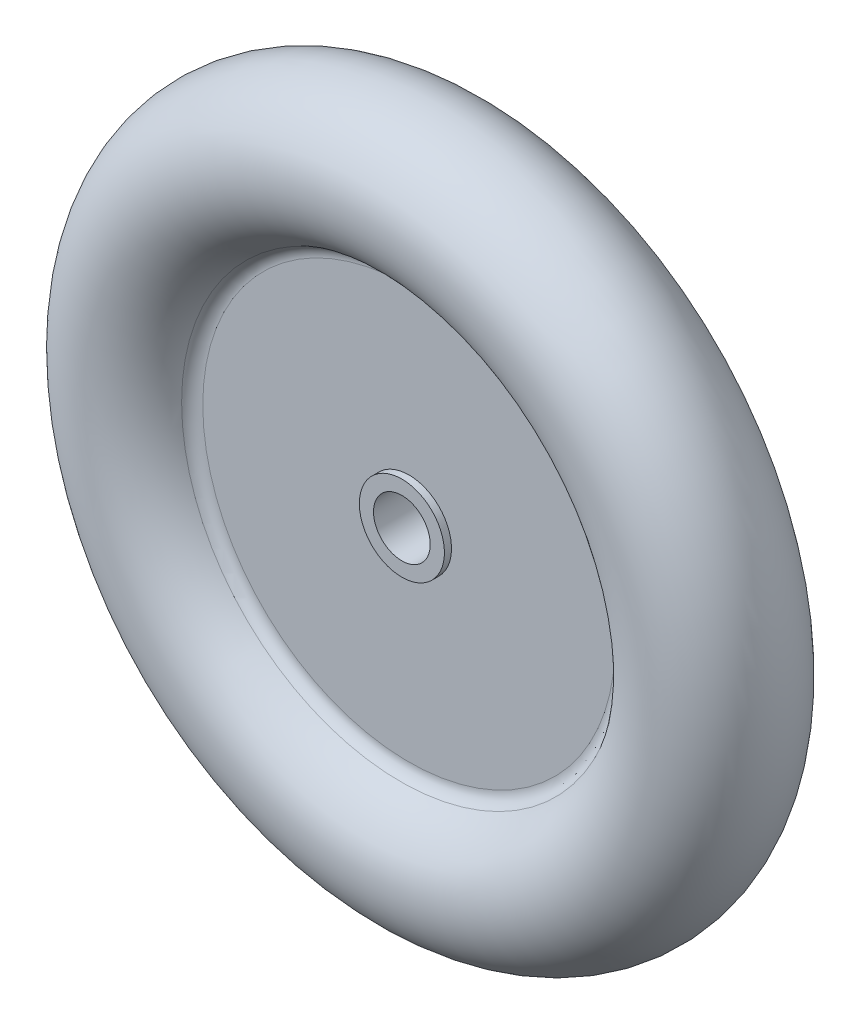
ISO-10303-21;
HEADER;
FILE_DESCRIPTION(('STEP AP214'),'2;1');
FILE_NAME('part.step','',(''),(''),'','','');
FILE_SCHEMA(('AUTOMOTIVE_DESIGN { 1 0 10303 214 1 1 1 1 }'));
ENDSEC;
DATA;
#1=APPLICATION_CONTEXT('core data for automotive mechanical design processes');
#2=APPLICATION_PROTOCOL_DEFINITION('international standard','automotive_design',2000,#1);
#3=PRODUCT_CONTEXT('',#1,'mechanical');
#4=PRODUCT('Part','Part','',(#3));
#5=PRODUCT_RELATED_PRODUCT_CATEGORY('part','',(#4));
#6=PRODUCT_DEFINITION_FORMATION('','',#4);
#7=PRODUCT_DEFINITION_CONTEXT('part definition',#1,'design');
#8=PRODUCT_DEFINITION('design','',#6,#7);
#9=PRODUCT_DEFINITION_SHAPE('','',#8);
#10=(LENGTH_UNIT() NAMED_UNIT(*) SI_UNIT(.MILLI.,.METRE.));
#11=(NAMED_UNIT(*) PLANE_ANGLE_UNIT() SI_UNIT($,.RADIAN.));
#12=(NAMED_UNIT(*) SI_UNIT($,.STERADIAN.) SOLID_ANGLE_UNIT());
#13=UNCERTAINTY_MEASURE_WITH_UNIT(LENGTH_MEASURE(1.E-05),#10,'distance_accuracy_value','');
#14=(GEOMETRIC_REPRESENTATION_CONTEXT(3) GLOBAL_UNCERTAINTY_ASSIGNED_CONTEXT((#13)) GLOBAL_UNIT_ASSIGNED_CONTEXT((#10,
#11,#12)) REPRESENTATION_CONTEXT('',''));
#15=CARTESIAN_POINT('',(0.,0.,0.));
#16=DIRECTION('',(0.,0.,1.));
#17=DIRECTION('',(1.,0.,0.));
#18=AXIS2_PLACEMENT_3D('',#15,#16,#17);
#19=CARTESIAN_POINT('',(0.,2.,-2.));
#20=DIRECTION('',(0.,0.,-1.));
#21=DIRECTION('',(-1.,0.,0.));
#22=AXIS2_PLACEMENT_3D('',#19,#20,#21);
#23=PLANE('',#22);
#24=CARTESIAN_POINT('',(0.,0.,-2.));
#25=DIRECTION('',(0.,0.,-1.));
#26=DIRECTION('',(-1.,0.,0.));
#27=AXIS2_PLACEMENT_3D('',#24,#25,#26);
#28=CIRCLE('',#27,3.);
#29=CARTESIAN_POINT('',(-3.,0.,-2.));
#30=VERTEX_POINT('',#29);
#31=EDGE_CURVE('E10',#30,#30,#28,.T.);
#32=ORIENTED_EDGE('',*,*,#31,.T.);
#33=EDGE_LOOP('',(#32));
#34=FACE_BOUND('',#33,.T.);
#35=CARTESIAN_POINT('',(0.,0.,-2.));
#36=DIRECTION('',(0.,0.,-1.));
#37=DIRECTION('',(-1.,0.,0.));
#38=AXIS2_PLACEMENT_3D('',#35,#36,#37);
#39=CIRCLE('',#38,2.);
#40=CARTESIAN_POINT('',(-2.,0.,-2.));
#41=VERTEX_POINT('',#40);
#42=EDGE_CURVE('E62',#41,#41,#39,.T.);
#43=ORIENTED_EDGE('',*,*,#42,.F.);
#44=EDGE_LOOP('',(#43));
#45=FACE_BOUND('',#44,.T.);
#46=ADVANCED_FACE('F28',(#34,#45),#23,.T.);
#47=CARTESIAN_POINT('',(0.,0.,-18.1622037914692));
#48=DIRECTION('',(0.,0.,-1.));
#49=DIRECTION('',(-1.,0.,0.));
#50=AXIS2_PLACEMENT_3D('',#47,#48,#49);
#51=CYLINDRICAL_SURFACE('',#50,3.);
#52=CARTESIAN_POINT('',(0.,0.,-1.5));
#53=DIRECTION('',(0.,0.,-1.));
#54=DIRECTION('',(-1.,0.,0.));
#55=AXIS2_PLACEMENT_3D('',#52,#53,#54);
#56=CIRCLE('',#55,3.);
#57=CARTESIAN_POINT('',(-3.,0.,-1.5));
#58=VERTEX_POINT('',#57);
#59=EDGE_CURVE('E34',#58,#58,#56,.T.);
#60=ORIENTED_EDGE('',*,*,#59,.T.);
#61=EDGE_LOOP('',(#60));
#62=FACE_BOUND('',#61,.T.);
#63=ORIENTED_EDGE('',*,*,#31,.F.);
#64=EDGE_LOOP('',(#63));
#65=FACE_BOUND('',#64,.T.);
#66=ADVANCED_FACE('F70',(#62,#65),#51,.T.);
#67=CARTESIAN_POINT('',(0.,3.,-1.5));
#68=DIRECTION('',(0.,0.,-1.));
#69=DIRECTION('',(-1.,0.,0.));
#70=AXIS2_PLACEMENT_3D('',#67,#68,#69);
#71=PLANE('',#70);
#72=CARTESIAN_POINT('',(0.,0.,-1.5));
#73=DIRECTION('',(0.,0.,-1.));
#74=DIRECTION('',(-1.,0.,0.));
#75=AXIS2_PLACEMENT_3D('',#72,#73,#74);
#76=CIRCLE('',#75,14.5456439426821);
#77=CARTESIAN_POINT('',(-14.5456439426821,0.,-1.5));
#78=VERTEX_POINT('',#77);
#79=EDGE_CURVE('E38',#78,#78,#76,.T.);
#80=ORIENTED_EDGE('',*,*,#79,.T.);
#81=EDGE_LOOP('',(#80));
#82=FACE_BOUND('',#81,.T.);
#83=ORIENTED_EDGE('',*,*,#59,.F.);
#84=EDGE_LOOP('',(#83));
#85=FACE_BOUND('',#84,.T.);
#86=ADVANCED_FACE('F74',(#82,#85),#71,.T.);
#87=CARTESIAN_POINT('',(0.,0.,-2.5));
#88=DIRECTION('',(0.,0.,-1.));
#89=DIRECTION('',(-1.,0.,0.));
#90=AXIS2_PLACEMENT_3D('',#87,#88,#89);
#91=TOROIDAL_SURFACE('',#90,14.5456439426821,1.);
#92=CARTESIAN_POINT('',(0.,0.,-2.08333333333333));
#93=DIRECTION('',(0.,0.,-1.));
#94=DIRECTION('',(-1.,0.,0.));
#95=AXIS2_PLACEMENT_3D('',#92,#93,#94);
#96=CIRCLE('',#95,15.4547032855685);
#97=CARTESIAN_POINT('',(-15.4547032855685,0.,-2.08333333333333));
#98=VERTEX_POINT('',#97);
#99=EDGE_CURVE('E42',#98,#98,#96,.T.);
#100=ORIENTED_EDGE('',*,*,#99,.T.);
#101=EDGE_LOOP('',(#100));
#102=FACE_BOUND('',#101,.T.);
#103=ORIENTED_EDGE('',*,*,#79,.F.);
#104=EDGE_LOOP('',(#103));
#105=FACE_BOUND('',#104,.T.);
#106=ADVANCED_FACE('F78',(#102,#105),#91,.F.);
#107=CARTESIAN_POINT('',(0.,0.,0.));
#108=DIRECTION('',(0.,0.,-1.));
#109=DIRECTION('',(-1.,0.,0.));
#110=AXIS2_PLACEMENT_3D('',#107,#108,#109);
#111=TOROIDAL_SURFACE('',#110,20.,5.);
#112=CARTESIAN_POINT('',(0.,0.,2.08333333333333));
#113=DIRECTION('',(0.,0.,-1.));
#114=DIRECTION('',(-1.,0.,0.));
#115=AXIS2_PLACEMENT_3D('',#112,#113,#114);
#116=CIRCLE('',#115,15.4547032855685);
#117=CARTESIAN_POINT('',(-15.4547032855685,0.,2.08333333333333));
#118=VERTEX_POINT('',#117);
#119=EDGE_CURVE('E47',#118,#118,#116,.T.);
#120=ORIENTED_EDGE('',*,*,#119,.T.);
#121=EDGE_LOOP('',(#120));
#122=FACE_BOUND('',#121,.T.);
#123=ORIENTED_EDGE('',*,*,#99,.F.);
#124=EDGE_LOOP('',(#123));
#125=FACE_BOUND('',#124,.T.);
#126=ADVANCED_FACE('F85',(#122,#125),#111,.T.);
#127=CARTESIAN_POINT('',(0.,0.,2.5));
#128=DIRECTION('',(0.,0.,-1.));
#129=DIRECTION('',(-1.,0.,0.));
#130=AXIS2_PLACEMENT_3D('',#127,#128,#129);
#131=TOROIDAL_SURFACE('',#130,14.5456439426821,1.);
#132=CARTESIAN_POINT('',(0.,0.,1.5));
#133=DIRECTION('',(0.,0.,-1.));
#134=DIRECTION('',(-1.,0.,0.));
#135=AXIS2_PLACEMENT_3D('',#132,#133,#134);
#136=CIRCLE('',#135,14.5456439426821);
#137=CARTESIAN_POINT('',(-14.5456439426821,0.,1.5));
#138=VERTEX_POINT('',#137);
#139=EDGE_CURVE('E50',#138,#138,#136,.T.);
#140=ORIENTED_EDGE('',*,*,#139,.T.);
#141=EDGE_LOOP('',(#140));
#142=FACE_BOUND('',#141,.T.);
#143=ORIENTED_EDGE('',*,*,#119,.F.);
#144=EDGE_LOOP('',(#143));
#145=FACE_BOUND('',#144,.T.);
#146=ADVANCED_FACE('F89',(#142,#145),#131,.F.);
#147=CARTESIAN_POINT('',(0.,3.,1.5));
#148=DIRECTION('',(0.,0.,1.));
#149=DIRECTION('',(1.,0.,0.));
#150=AXIS2_PLACEMENT_3D('',#147,#148,#149);
#151=PLANE('',#150);
#152=CARTESIAN_POINT('',(0.,0.,1.5));
#153=DIRECTION('',(0.,0.,-1.));
#154=DIRECTION('',(-1.,0.,0.));
#155=AXIS2_PLACEMENT_3D('',#152,#153,#154);
#156=CIRCLE('',#155,3.);
#157=CARTESIAN_POINT('',(-3.,0.,1.5));
#158=VERTEX_POINT('',#157);
#159=EDGE_CURVE('E53',#158,#158,#156,.T.);
#160=ORIENTED_EDGE('',*,*,#159,.T.);
#161=EDGE_LOOP('',(#160));
#162=FACE_BOUND('',#161,.T.);
#163=ORIENTED_EDGE('',*,*,#139,.F.);
#164=EDGE_LOOP('',(#163));
#165=FACE_BOUND('',#164,.T.);
#166=ADVANCED_FACE('F93',(#162,#165),#151,.T.);
#167=CARTESIAN_POINT('',(0.,0.,-18.1622037914692));
#168=DIRECTION('',(0.,0.,-1.));
#169=DIRECTION('',(-1.,0.,0.));
#170=AXIS2_PLACEMENT_3D('',#167,#168,#169);
#171=CYLINDRICAL_SURFACE('',#170,3.);
#172=CARTESIAN_POINT('',(0.,0.,2.));
#173=DIRECTION('',(0.,0.,-1.));
#174=DIRECTION('',(-1.,0.,0.));
#175=AXIS2_PLACEMENT_3D('',#172,#173,#174);
#176=CIRCLE('',#175,3.);
#177=CARTESIAN_POINT('',(-3.,0.,2.));
#178=VERTEX_POINT('',#177);
#179=EDGE_CURVE('E56',#178,#178,#176,.T.);
#180=ORIENTED_EDGE('',*,*,#179,.T.);
#181=EDGE_LOOP('',(#180));
#182=FACE_BOUND('',#181,.T.);
#183=ORIENTED_EDGE('',*,*,#159,.F.);
#184=EDGE_LOOP('',(#183));
#185=FACE_BOUND('',#184,.T.);
#186=ADVANCED_FACE('F97',(#182,#185),#171,.T.);
#187=CARTESIAN_POINT('',(0.,2.,2.));
#188=DIRECTION('',(0.,0.,1.));
#189=DIRECTION('',(1.,0.,0.));
#190=AXIS2_PLACEMENT_3D('',#187,#188,#189);
#191=PLANE('',#190);
#192=CARTESIAN_POINT('',(0.,0.,2.));
#193=DIRECTION('',(0.,0.,-1.));
#194=DIRECTION('',(-1.,0.,0.));
#195=AXIS2_PLACEMENT_3D('',#192,#193,#194);
#196=CIRCLE('',#195,2.);
#197=CARTESIAN_POINT('',(-2.,0.,2.));
#198=VERTEX_POINT('',#197);
#199=EDGE_CURVE('E59',#198,#198,#196,.T.);
#200=ORIENTED_EDGE('',*,*,#199,.T.);
#201=EDGE_LOOP('',(#200));
#202=FACE_BOUND('',#201,.T.);
#203=ORIENTED_EDGE('',*,*,#179,.F.);
#204=EDGE_LOOP('',(#203));
#205=FACE_BOUND('',#204,.T.);
#206=ADVANCED_FACE('F101',(#202,#205),#191,.T.);
#207=CARTESIAN_POINT('',(0.,0.,-18.1622037914692));
#208=DIRECTION('',(0.,0.,-1.));
#209=DIRECTION('',(-1.,0.,0.));
#210=AXIS2_PLACEMENT_3D('',#207,#208,#209);
#211=CYLINDRICAL_SURFACE('',#210,2.);
#212=ORIENTED_EDGE('',*,*,#42,.T.);
#213=EDGE_LOOP('',(#212));
#214=FACE_BOUND('',#213,.T.);
#215=ORIENTED_EDGE('',*,*,#199,.F.);
#216=EDGE_LOOP('',(#215));
#217=FACE_BOUND('',#216,.T.);
#218=ADVANCED_FACE('F66',(#214,#217),#211,.F.);
#219=CLOSED_SHELL('',(#46,#66,#86,#106,#126,#146,#166,#186,#206,#218));
#220=MANIFOLD_SOLID_BREP('B2',#219);
#221=ADVANCED_BREP_SHAPE_REPRESENTATION('',(#18,#220),#14);
#222=SHAPE_DEFINITION_REPRESENTATION(#9,#221);
ENDSEC;
END-ISO-10303-21;
